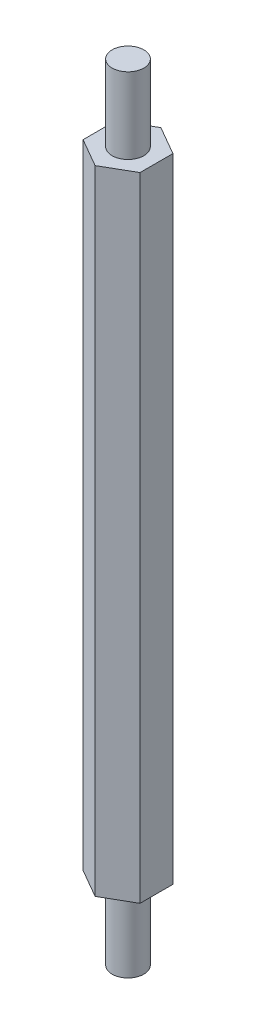
ISO-10303-21;
HEADER;
FILE_DESCRIPTION(('STEP AP214'),'2;1');
FILE_NAME('part.step','',(''),(''),'','','');
FILE_SCHEMA(('AUTOMOTIVE_DESIGN { 1 0 10303 214 1 1 1 1 }'));
ENDSEC;
DATA;
#1=APPLICATION_CONTEXT('core data for automotive mechanical design processes');
#2=APPLICATION_PROTOCOL_DEFINITION('international standard','automotive_design',2000,#1);
#3=PRODUCT_CONTEXT('',#1,'mechanical');
#4=PRODUCT('Part','Part','',(#3));
#5=PRODUCT_RELATED_PRODUCT_CATEGORY('part','',(#4));
#6=PRODUCT_DEFINITION_FORMATION('','',#4);
#7=PRODUCT_DEFINITION_CONTEXT('part definition',#1,'design');
#8=PRODUCT_DEFINITION('design','',#6,#7);
#9=PRODUCT_DEFINITION_SHAPE('','',#8);
#10=(LENGTH_UNIT() NAMED_UNIT(*) SI_UNIT(.MILLI.,.METRE.));
#11=(NAMED_UNIT(*) PLANE_ANGLE_UNIT() SI_UNIT($,.RADIAN.));
#12=(NAMED_UNIT(*) SI_UNIT($,.STERADIAN.) SOLID_ANGLE_UNIT());
#13=UNCERTAINTY_MEASURE_WITH_UNIT(LENGTH_MEASURE(1.E-05),#10,'distance_accuracy_value','');
#14=(GEOMETRIC_REPRESENTATION_CONTEXT(3) GLOBAL_UNCERTAINTY_ASSIGNED_CONTEXT((#13)) GLOBAL_UNIT_ASSIGNED_CONTEXT((#10,
#11,#12)) REPRESENTATION_CONTEXT('',''));
#15=CARTESIAN_POINT('',(0.,0.,0.));
#16=DIRECTION('',(0.,0.,1.));
#17=DIRECTION('',(1.,0.,0.));
#18=AXIS2_PLACEMENT_3D('',#15,#16,#17);
#19=CARTESIAN_POINT('',(0.,25.,2.59807621135332));
#20=DIRECTION('',(-0.5,0.,-0.866025403784439));
#21=DIRECTION('',(-0.866025403784439,0.,0.5));
#22=AXIS2_PLACEMENT_3D('',#19,#20,#21);
#23=PLANE('',#22);
#24=DIRECTION('',(0.866025403784439,0.,-0.5));
#25=VECTOR('',#24,1.);
#26=CARTESIAN_POINT('',(0.,-25.,2.59807621135332));
#27=LINE('',#26,#25);
#28=CARTESIAN_POINT('',(0.,-25.,2.59807621135332));
#29=VERTEX_POINT('',#28);
#30=CARTESIAN_POINT('',(2.25,-25.,1.29903810567666));
#31=VERTEX_POINT('',#30);
#32=EDGE_CURVE('E124',#29,#31,#27,.T.);
#33=ORIENTED_EDGE('',*,*,#32,.T.);
#34=DIRECTION('',(0.,-1.,0.));
#35=VECTOR('',#34,1.);
#36=CARTESIAN_POINT('',(2.25,25.,1.29903810567666));
#37=LINE('',#36,#35);
#38=CARTESIAN_POINT('',(2.25,25.,1.29903810567666));
#39=VERTEX_POINT('',#38);
#40=EDGE_CURVE('E47',#39,#31,#37,.T.);
#41=ORIENTED_EDGE('',*,*,#40,.F.);
#42=DIRECTION('',(0.866025403784439,0.,-0.5));
#43=VECTOR('',#42,1.);
#44=CARTESIAN_POINT('',(0.,25.,2.59807621135332));
#45=LINE('',#44,#43);
#46=CARTESIAN_POINT('',(0.,25.,2.59807621135332));
#47=VERTEX_POINT('',#46);
#48=EDGE_CURVE('E135',#47,#39,#45,.T.);
#49=ORIENTED_EDGE('',*,*,#48,.F.);
#50=DIRECTION('',(0.,-1.,0.));
#51=VECTOR('',#50,1.);
#52=CARTESIAN_POINT('',(0.,25.,2.59807621135332));
#53=LINE('',#52,#51);
#54=EDGE_CURVE('E120',#47,#29,#53,.T.);
#55=ORIENTED_EDGE('',*,*,#54,.T.);
#56=EDGE_LOOP('',(#33,#41,#49,#55));
#57=FACE_BOUND('',#56,.T.);
#58=ADVANCED_FACE('F39',(#57),#23,.F.);
#59=CARTESIAN_POINT('',(2.25,25.,1.29903810567666));
#60=DIRECTION('',(-1.,0.,0.));
#61=DIRECTION('',(0.,0.,1.));
#62=AXIS2_PLACEMENT_3D('',#59,#60,#61);
#63=PLANE('',#62);
#64=DIRECTION('',(0.,0.,-1.));
#65=VECTOR('',#64,1.);
#66=CARTESIAN_POINT('',(2.25,-25.,1.29903810567666));
#67=LINE('',#66,#65);
#68=CARTESIAN_POINT('',(2.25,-25.,-1.29903810567666));
#69=VERTEX_POINT('',#68);
#70=EDGE_CURVE('E127',#31,#69,#67,.T.);
#71=ORIENTED_EDGE('',*,*,#70,.T.);
#72=DIRECTION('',(0.,-1.,0.));
#73=VECTOR('',#72,1.);
#74=CARTESIAN_POINT('',(2.25,25.,-1.29903810567666));
#75=LINE('',#74,#73);
#76=CARTESIAN_POINT('',(2.25,25.,-1.29903810567666));
#77=VERTEX_POINT('',#76);
#78=EDGE_CURVE('E139',#77,#69,#75,.T.);
#79=ORIENTED_EDGE('',*,*,#78,.F.);
#80=DIRECTION('',(0.,0.,-1.));
#81=VECTOR('',#80,1.);
#82=CARTESIAN_POINT('',(2.25,25.,1.29903810567666));
#83=LINE('',#82,#81);
#84=EDGE_CURVE('E93',#39,#77,#83,.T.);
#85=ORIENTED_EDGE('',*,*,#84,.F.);
#86=ORIENTED_EDGE('',*,*,#40,.T.);
#87=EDGE_LOOP('',(#71,#79,#85,#86));
#88=FACE_BOUND('',#87,.T.);
#89=ADVANCED_FACE('F142',(#88),#63,.F.);
#90=CARTESIAN_POINT('',(2.25,25.,-1.29903810567666));
#91=DIRECTION('',(-0.5,0.,0.866025403784439));
#92=DIRECTION('',(0.866025403784439,0.,0.5));
#93=AXIS2_PLACEMENT_3D('',#90,#91,#92);
#94=PLANE('',#93);
#95=DIRECTION('',(-0.866025403784439,0.,-0.5));
#96=VECTOR('',#95,1.);
#97=CARTESIAN_POINT('',(2.25,-25.,-1.29903810567666));
#98=LINE('',#97,#96);
#99=CARTESIAN_POINT('',(0.,-25.,-2.59807621135332));
#100=VERTEX_POINT('',#99);
#101=EDGE_CURVE('E130',#69,#100,#98,.T.);
#102=ORIENTED_EDGE('',*,*,#101,.T.);
#103=DIRECTION('',(0.,-1.,0.));
#104=VECTOR('',#103,1.);
#105=CARTESIAN_POINT('',(0.,25.,-2.59807621135332));
#106=LINE('',#105,#104);
#107=CARTESIAN_POINT('',(0.,25.,-2.59807621135332));
#108=VERTEX_POINT('',#107);
#109=EDGE_CURVE('E115',#108,#100,#106,.T.);
#110=ORIENTED_EDGE('',*,*,#109,.F.);
#111=DIRECTION('',(-0.866025403784439,0.,-0.5));
#112=VECTOR('',#111,1.);
#113=CARTESIAN_POINT('',(2.25,25.,-1.29903810567666));
#114=LINE('',#113,#112);
#115=EDGE_CURVE('E106',#77,#108,#114,.T.);
#116=ORIENTED_EDGE('',*,*,#115,.F.);
#117=ORIENTED_EDGE('',*,*,#78,.T.);
#118=EDGE_LOOP('',(#102,#110,#116,#117));
#119=FACE_BOUND('',#118,.T.);
#120=ADVANCED_FACE('F150',(#119),#94,.F.);
#121=CARTESIAN_POINT('',(0.,25.,-2.59807621135332));
#122=DIRECTION('',(0.5,0.,0.866025403784439));
#123=DIRECTION('',(0.866025403784439,0.,-0.5));
#124=AXIS2_PLACEMENT_3D('',#121,#122,#123);
#125=PLANE('',#124);
#126=DIRECTION('',(-0.866025403784439,0.,0.5));
#127=VECTOR('',#126,1.);
#128=CARTESIAN_POINT('',(0.,-25.,-2.59807621135332));
#129=LINE('',#128,#127);
#130=CARTESIAN_POINT('',(-2.25,-25.,-1.29903810567666));
#131=VERTEX_POINT('',#130);
#132=EDGE_CURVE('E114',#100,#131,#129,.T.);
#133=ORIENTED_EDGE('',*,*,#132,.T.);
#134=DIRECTION('',(0.,-1.,0.));
#135=VECTOR('',#134,1.);
#136=CARTESIAN_POINT('',(-2.25,25.,-1.29903810567666));
#137=LINE('',#136,#135);
#138=CARTESIAN_POINT('',(-2.25,25.,-1.29903810567666));
#139=VERTEX_POINT('',#138);
#140=EDGE_CURVE('E111',#139,#131,#137,.T.);
#141=ORIENTED_EDGE('',*,*,#140,.F.);
#142=DIRECTION('',(-0.866025403784439,0.,0.5));
#143=VECTOR('',#142,1.);
#144=CARTESIAN_POINT('',(0.,25.,-2.59807621135332));
#145=LINE('',#144,#143);
#146=EDGE_CURVE('E100',#108,#139,#145,.T.);
#147=ORIENTED_EDGE('',*,*,#146,.F.);
#148=ORIENTED_EDGE('',*,*,#109,.T.);
#149=EDGE_LOOP('',(#133,#141,#147,#148));
#150=FACE_BOUND('',#149,.T.);
#151=ADVANCED_FACE('F112',(#150),#125,.F.);
#152=CARTESIAN_POINT('',(-2.25,25.,-1.29903810567666));
#153=DIRECTION('',(1.,0.,0.));
#154=DIRECTION('',(0.,0.,-1.));
#155=AXIS2_PLACEMENT_3D('',#152,#153,#154);
#156=PLANE('',#155);
#157=DIRECTION('',(0.,0.,1.));
#158=VECTOR('',#157,1.);
#159=CARTESIAN_POINT('',(-2.25,-25.,-1.29903810567666));
#160=LINE('',#159,#158);
#161=CARTESIAN_POINT('',(-2.25,-25.,1.29903810567666));
#162=VERTEX_POINT('',#161);
#163=EDGE_CURVE('E78',#131,#162,#160,.T.);
#164=ORIENTED_EDGE('',*,*,#163,.T.);
#165=DIRECTION('',(0.,-1.,0.));
#166=VECTOR('',#165,1.);
#167=CARTESIAN_POINT('',(-2.25,25.,1.29903810567666));
#168=LINE('',#167,#166);
#169=CARTESIAN_POINT('',(-2.25,25.,1.29903810567666));
#170=VERTEX_POINT('',#169);
#171=EDGE_CURVE('E116',#170,#162,#168,.T.);
#172=ORIENTED_EDGE('',*,*,#171,.F.);
#173=DIRECTION('',(0.,0.,1.));
#174=VECTOR('',#173,1.);
#175=CARTESIAN_POINT('',(-2.25,25.,-1.29903810567666));
#176=LINE('',#175,#174);
#177=EDGE_CURVE('E104',#139,#170,#176,.T.);
#178=ORIENTED_EDGE('',*,*,#177,.F.);
#179=ORIENTED_EDGE('',*,*,#140,.T.);
#180=EDGE_LOOP('',(#164,#172,#178,#179));
#181=FACE_BOUND('',#180,.T.);
#182=ADVANCED_FACE('F118',(#181),#156,.F.);
#183=CARTESIAN_POINT('',(-2.25,25.,1.29903810567666));
#184=DIRECTION('',(0.5,0.,-0.866025403784438));
#185=DIRECTION('',(-0.866025403784439,0.,-0.5));
#186=AXIS2_PLACEMENT_3D('',#183,#184,#185);
#187=PLANE('',#186);
#188=DIRECTION('',(0.866025403784438,0.,0.5));
#189=VECTOR('',#188,1.);
#190=CARTESIAN_POINT('',(-2.25,-25.,1.29903810567666));
#191=LINE('',#190,#189);
#192=EDGE_CURVE('E84',#162,#29,#191,.T.);
#193=ORIENTED_EDGE('',*,*,#192,.T.);
#194=ORIENTED_EDGE('',*,*,#54,.F.);
#195=DIRECTION('',(0.866025403784438,0.,0.5));
#196=VECTOR('',#195,1.);
#197=CARTESIAN_POINT('',(-2.25,25.,1.29903810567666));
#198=LINE('',#197,#196);
#199=EDGE_CURVE('E55',#170,#47,#198,.T.);
#200=ORIENTED_EDGE('',*,*,#199,.F.);
#201=ORIENTED_EDGE('',*,*,#171,.T.);
#202=EDGE_LOOP('',(#193,#194,#200,#201));
#203=FACE_BOUND('',#202,.T.);
#204=ADVANCED_FACE('F193',(#203),#187,.F.);
#205=CARTESIAN_POINT('',(0.,25.,0.));
#206=DIRECTION('',(0.,1.,0.));
#207=DIRECTION('',(0.,0.,1.));
#208=AXIS2_PLACEMENT_3D('',#205,#206,#207);
#209=PLANE('',#208);
#210=CARTESIAN_POINT('',(0.,25.,0.));
#211=DIRECTION('',(0.,1.,0.));
#212=DIRECTION('',(0.,0.,1.));
#213=AXIS2_PLACEMENT_3D('',#210,#211,#212);
#214=CIRCLE('',#213,1.25);
#215=CARTESIAN_POINT('',(0.,25.,1.25));
#216=VERTEX_POINT('',#215);
#217=EDGE_CURVE('E128',#216,#216,#214,.F.);
#218=ORIENTED_EDGE('',*,*,#217,.T.);
#219=EDGE_LOOP('',(#218));
#220=FACE_BOUND('',#219,.T.);
#221=ORIENTED_EDGE('',*,*,#48,.T.);
#222=ORIENTED_EDGE('',*,*,#84,.T.);
#223=ORIENTED_EDGE('',*,*,#115,.T.);
#224=ORIENTED_EDGE('',*,*,#146,.T.);
#225=ORIENTED_EDGE('',*,*,#177,.T.);
#226=ORIENTED_EDGE('',*,*,#199,.T.);
#227=EDGE_LOOP('',(#221,#222,#223,#224,#225,#226));
#228=FACE_BOUND('',#227,.T.);
#229=ADVANCED_FACE('F102',(#220,#228),#209,.T.);
#230=CARTESIAN_POINT('',(0.,-25.,0.));
#231=DIRECTION('',(0.,1.,0.));
#232=DIRECTION('',(0.,0.,1.));
#233=AXIS2_PLACEMENT_3D('',#230,#231,#232);
#234=PLANE('',#233);
#235=CARTESIAN_POINT('',(0.,-25.,0.));
#236=DIRECTION('',(0.,1.,0.));
#237=DIRECTION('',(0.,0.,1.));
#238=AXIS2_PLACEMENT_3D('',#235,#236,#237);
#239=CIRCLE('',#238,1.25);
#240=CARTESIAN_POINT('',(0.,-25.,1.25));
#241=VERTEX_POINT('',#240);
#242=EDGE_CURVE('E11',#241,#241,#239,.F.);
#243=ORIENTED_EDGE('',*,*,#242,.F.);
#244=EDGE_LOOP('',(#243));
#245=FACE_BOUND('',#244,.T.);
#246=ORIENTED_EDGE('',*,*,#32,.F.);
#247=ORIENTED_EDGE('',*,*,#192,.F.);
#248=ORIENTED_EDGE('',*,*,#163,.F.);
#249=ORIENTED_EDGE('',*,*,#132,.F.);
#250=ORIENTED_EDGE('',*,*,#101,.F.);
#251=ORIENTED_EDGE('',*,*,#70,.F.);
#252=EDGE_LOOP('',(#246,#247,#248,#249,#250,#251));
#253=FACE_BOUND('',#252,.T.);
#254=ADVANCED_FACE('F147',(#245,#253),#234,.F.);
#255=CARTESIAN_POINT('',(0.,-31.,0.));
#256=DIRECTION('',(0.,1.,0.));
#257=DIRECTION('',(0.,0.,1.));
#258=AXIS2_PLACEMENT_3D('',#255,#256,#257);
#259=PLANE('',#258);
#260=CARTESIAN_POINT('',(0.,-31.,0.));
#261=DIRECTION('',(0.,1.,0.));
#262=DIRECTION('',(0.,0.,1.));
#263=AXIS2_PLACEMENT_3D('',#260,#261,#262);
#264=CIRCLE('',#263,1.25);
#265=CARTESIAN_POINT('',(0.,-31.,1.25));
#266=VERTEX_POINT('',#265);
#267=EDGE_CURVE('E157',#266,#266,#264,.T.);
#268=ORIENTED_EDGE('',*,*,#267,.F.);
#269=EDGE_LOOP('',(#268));
#270=FACE_BOUND('',#269,.T.);
#271=ADVANCED_FACE('F175',(#270),#259,.F.);
#272=CARTESIAN_POINT('',(0.,31.,0.));
#273=DIRECTION('',(0.,-1.,0.));
#274=DIRECTION('',(0.,0.,-1.));
#275=AXIS2_PLACEMENT_3D('',#272,#273,#274);
#276=CYLINDRICAL_SURFACE('',#275,1.25);
#277=ORIENTED_EDGE('',*,*,#267,.T.);
#278=EDGE_LOOP('',(#277));
#279=FACE_BOUND('',#278,.T.);
#280=ORIENTED_EDGE('',*,*,#242,.T.);
#281=EDGE_LOOP('',(#280));
#282=FACE_BOUND('',#281,.T.);
#283=ADVANCED_FACE('F167',(#279,#282),#276,.T.);
#284=ORIENTED_EDGE('',*,*,#217,.F.);
#285=EDGE_LOOP('',(#284));
#286=FACE_BOUND('',#285,.T.);
#287=CARTESIAN_POINT('',(0.,31.,0.));
#288=DIRECTION('',(0.,1.,0.));
#289=DIRECTION('',(0.,0.,1.));
#290=AXIS2_PLACEMENT_3D('',#287,#288,#289);
#291=CIRCLE('',#290,1.25);
#292=CARTESIAN_POINT('',(0.,31.,1.25));
#293=VERTEX_POINT('',#292);
#294=EDGE_CURVE('E156',#293,#293,#291,.T.);
#295=ORIENTED_EDGE('',*,*,#294,.F.);
#296=EDGE_LOOP('',(#295));
#297=FACE_BOUND('',#296,.T.);
#298=ADVANCED_FACE('F165',(#286,#297),#276,.T.);
#299=CARTESIAN_POINT('',(0.,31.,0.));
#300=DIRECTION('',(0.,1.,0.));
#301=DIRECTION('',(0.,0.,1.));
#302=AXIS2_PLACEMENT_3D('',#299,#300,#301);
#303=PLANE('',#302);
#304=ORIENTED_EDGE('',*,*,#294,.T.);
#305=EDGE_LOOP('',(#304));
#306=FACE_BOUND('',#305,.T.);
#307=ADVANCED_FACE('F163',(#306),#303,.T.);
#308=CLOSED_SHELL('',(#58,#89,#120,#151,#182,#204,#229,#254,#271,#283,#298,#307));
#309=MANIFOLD_SOLID_BREP('B2',#308);
#310=ADVANCED_BREP_SHAPE_REPRESENTATION('',(#18,#309),#14);
#311=SHAPE_DEFINITION_REPRESENTATION(#9,#310);
ENDSEC;
END-ISO-10303-21;
